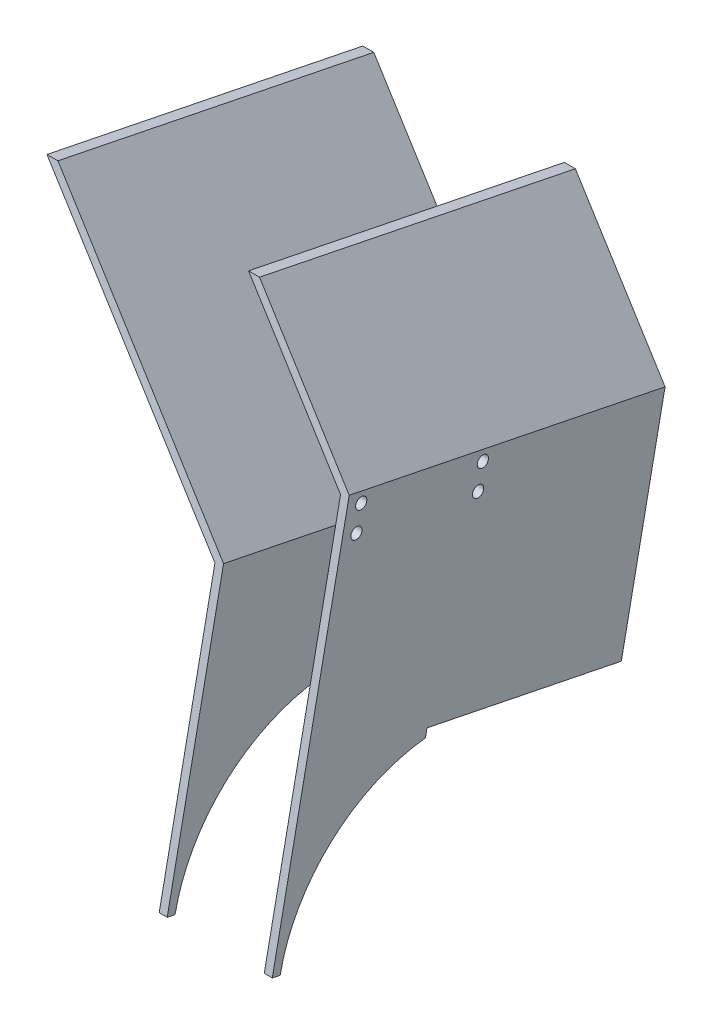
ISO-10303-21;
HEADER;
FILE_DESCRIPTION(('STEP AP214'),'2;1');
FILE_NAME('part.step','',(''),(''),'','','');
FILE_SCHEMA(('AUTOMOTIVE_DESIGN { 1 0 10303 214 1 1 1 1 }'));
ENDSEC;
DATA;
#1=APPLICATION_CONTEXT('core data for automotive mechanical design processes');
#2=APPLICATION_PROTOCOL_DEFINITION('international standard','automotive_design',2000,#1);
#3=PRODUCT_CONTEXT('',#1,'mechanical');
#4=PRODUCT('Part','Part','',(#3));
#5=PRODUCT_RELATED_PRODUCT_CATEGORY('part','',(#4));
#6=PRODUCT_DEFINITION_FORMATION('','',#4);
#7=PRODUCT_DEFINITION_CONTEXT('part definition',#1,'design');
#8=PRODUCT_DEFINITION('design','',#6,#7);
#9=PRODUCT_DEFINITION_SHAPE('','',#8);
#10=(LENGTH_UNIT() NAMED_UNIT(*) SI_UNIT(.MILLI.,.METRE.));
#11=(NAMED_UNIT(*) PLANE_ANGLE_UNIT() SI_UNIT($,.RADIAN.));
#12=(NAMED_UNIT(*) SI_UNIT($,.STERADIAN.) SOLID_ANGLE_UNIT());
#13=UNCERTAINTY_MEASURE_WITH_UNIT(LENGTH_MEASURE(1.E-05),#10,'distance_accuracy_value','');
#14=(GEOMETRIC_REPRESENTATION_CONTEXT(3) GLOBAL_UNCERTAINTY_ASSIGNED_CONTEXT((#13)) GLOBAL_UNIT_ASSIGNED_CONTEXT((#10,
#11,#12)) REPRESENTATION_CONTEXT('',''));
#15=CARTESIAN_POINT('',(0.,0.,0.));
#16=DIRECTION('',(0.,0.,1.));
#17=DIRECTION('',(1.,0.,0.));
#18=AXIS2_PLACEMENT_3D('',#15,#16,#17);
#19=CARTESIAN_POINT('',(159.080275109057,1919.97424519418,76.7488064249174));
#20=DIRECTION('',(1.,0.,0.));
#21=DIRECTION('',(0.,1.,0.));
#22=AXIS2_PLACEMENT_3D('',#19,#20,#21);
#23=PLANE('',#22);
#24=CARTESIAN_POINT('',(159.080275109057,1897.13965743949,28.5631304945984));
#25=DIRECTION('',(1.,0.,0.));
#26=DIRECTION('',(0.,1.,0.));
#27=AXIS2_PLACEMENT_3D('',#24,#25,#26);
#28=CIRCLE('',#27,2.09999999999996);
#29=CARTESIAN_POINT('',(159.080275109057,1899.23965743949,28.5631304945984));
#30=VERTEX_POINT('',#29);
#31=EDGE_CURVE('E227',#30,#30,#28,.T.);
#32=ORIENTED_EDGE('',*,*,#31,.F.);
#33=EDGE_LOOP('',(#32));
#34=FACE_BOUND('',#33,.T.);
#35=CARTESIAN_POINT('',(159.080275109057,1906.35374225666,74.0376639702781));
#36=DIRECTION('',(1.,0.,0.));
#37=DIRECTION('',(0.,1.,0.));
#38=AXIS2_PLACEMENT_3D('',#35,#36,#37);
#39=CIRCLE('',#38,2.09999999999997);
#40=CARTESIAN_POINT('',(159.080275109057,1908.45374225666,74.0376639702781));
#41=VERTEX_POINT('',#40);
#42=EDGE_CURVE('E231',#41,#41,#39,.T.);
#43=ORIENTED_EDGE('',*,*,#42,.F.);
#44=EDGE_LOOP('',(#43));
#45=FACE_BOUND('',#44,.T.);
#46=CARTESIAN_POINT('',(159.080275109057,1915.17449474312,72.2503963426735));
#47=DIRECTION('',(1.,0.,0.));
#48=DIRECTION('',(0.,1.,0.));
#49=AXIS2_PLACEMENT_3D('',#46,#47,#48);
#50=CIRCLE('',#49,2.09999999999997);
#51=CARTESIAN_POINT('',(159.080275109057,1917.27449474312,72.2503963426735));
#52=VERTEX_POINT('',#51);
#53=EDGE_CURVE('E147',#52,#52,#50,.T.);
#54=ORIENTED_EDGE('',*,*,#53,.F.);
#55=EDGE_LOOP('',(#54));
#56=FACE_BOUND('',#55,.T.);
#57=CARTESIAN_POINT('',(159.080275109057,1905.96040992594,26.7758628669938));
#58=DIRECTION('',(1.,0.,0.));
#59=DIRECTION('',(0.,1.,0.));
#60=AXIS2_PLACEMENT_3D('',#57,#58,#59);
#61=CIRCLE('',#60,2.09999999999996);
#62=CARTESIAN_POINT('',(159.080275109057,1908.06040992594,26.7758628669938));
#63=VERTEX_POINT('',#62);
#64=EDGE_CURVE('E237',#63,#63,#61,.T.);
#65=ORIENTED_EDGE('',*,*,#64,.F.);
#66=EDGE_LOOP('',(#65));
#67=FACE_BOUND('',#66,.T.);
#68=DIRECTION('',(0.,-0.980083609606203,0.198585291956063));
#69=VECTOR('',#68,1.);
#70=CARTESIAN_POINT('',(159.080275109057,1919.97424519418,76.7488064249174));
#71=LINE('',#70,#69);
#72=CARTESIAN_POINT('',(159.080275109057,1919.97424519418,76.7488064249174));
#73=VERTEX_POINT('',#72);
#74=CARTESIAN_POINT('',(159.080275109057,1778.04751572434,105.506109099799));
#75=VERTEX_POINT('',#74);
#76=EDGE_CURVE('E124',#73,#75,#71,.T.);
#77=ORIENTED_EDGE('',*,*,#76,.T.);
#78=DIRECTION('',(0.,-0.198585291956079,-0.9800836096062));
#79=VECTOR('',#78,1.);
#80=CARTESIAN_POINT('',(159.080275109057,1778.04751572434,105.506109099799));
#81=LINE('',#80,#79);
#82=CARTESIAN_POINT('',(159.080275109057,1777.45175984848,102.56585827098));
#83=VERTEX_POINT('',#82);
#84=EDGE_CURVE('E131',#75,#83,#81,.T.);
#85=ORIENTED_EDGE('',*,*,#84,.T.);
#86=CARTESIAN_POINT('',(159.080275109057,1765.04017910122,41.3106326705928));
#87=DIRECTION('',(-1.,0.,0.));
#88=DIRECTION('',(0.,1.,0.));
#89=AXIS2_PLACEMENT_3D('',#86,#87,#88);
#90=CIRCLE('',#89,62.4999999999993);
#91=CARTESIAN_POINT('',(159.080275109057,1827.15431420823,48.2449112854723));
#92=VERTEX_POINT('',#91);
#93=EDGE_CURVE('E144',#83,#92,#90,.T.);
#94=ORIENTED_EDGE('',*,*,#93,.T.);
#95=DIRECTION('',(0.,0.980083609606205,-0.198585291956053));
#96=VECTOR('',#95,1.);
#97=CARTESIAN_POINT('',(159.080275109057,1830.09456503705,47.6491554096041));
#98=LINE('',#97,#96);
#99=CARTESIAN_POINT('',(159.080275109057,1830.09456503705,47.6491554096041));
#100=VERTEX_POINT('',#99);
#101=EDGE_CURVE('E140',#92,#100,#98,.T.);
#102=ORIENTED_EDGE('',*,*,#101,.T.);
#103=DIRECTION('',(0.,-0.198585291956063,-0.980083609606204));
#104=VECTOR('',#103,1.);
#105=CARTESIAN_POINT('',(159.080275109057,1839.30274132473,93.0945283525446));
#106=LINE('',#105,#104);
#107=CARTESIAN_POINT('',(159.080275109057,1815.37321364403,-25.0055466050029));
#108=VERTEX_POINT('',#107);
#109=EDGE_CURVE('E46',#100,#108,#106,.T.);
#110=ORIENTED_EDGE('',*,*,#109,.T.);
#111=DIRECTION('',(0.,-0.980083609606203,0.198585291956063));
#112=VECTOR('',#111,1.);
#113=CARTESIAN_POINT('',(159.080275109057,1896.04471751347,-41.3512685326301));
#114=LINE('',#113,#112);
#115=CARTESIAN_POINT('',(159.080275109057,1896.04471751347,-41.3512685326301));
#116=VERTEX_POINT('',#115);
#117=EDGE_CURVE('E157',#116,#108,#114,.T.);
#118=ORIENTED_EDGE('',*,*,#117,.F.);
#119=DIRECTION('',(0.,-0.198585291956063,-0.980083609606204));
#120=VECTOR('',#119,1.);
#121=CARTESIAN_POINT('',(159.080275109057,1919.97424519418,76.7488064249174));
#122=LINE('',#121,#120);
#123=EDGE_CURVE('E12',#73,#116,#122,.T.);
#124=ORIENTED_EDGE('',*,*,#123,.F.);
#125=EDGE_LOOP('',(#77,#85,#94,#102,#110,#118,#124));
#126=FACE_BOUND('',#125,.T.);
#127=ADVANCED_FACE('F43',(#34,#45,#56,#67,#126),#23,.T.);
#128=CARTESIAN_POINT('',(159.080275109057,1919.97424519418,76.7488064249174));
#129=DIRECTION('',(0.731353701619166,0.668415414475569,-0.135434843446568));
#130=DIRECTION('',(-0.674631295169795,0.738154872352358,0.));
#131=AXIS2_PLACEMENT_3D('',#128,#129,#130);
#132=PLANE('',#131);
#133=ORIENTED_EDGE('',*,*,#123,.T.);
#134=DIRECTION('',(0.681998360062503,-0.716787775781771,0.145236088359189));
#135=VECTOR('',#134,1.);
#136=CARTESIAN_POINT('',(159.080275109057,1896.04471751347,-41.3512685326301));
#137=LINE('',#136,#135);
#138=CARTESIAN_POINT('',(116.474442893766,1940.82391567185,-50.4244639750205));
#139=VERTEX_POINT('',#138);
#140=EDGE_CURVE('E175',#139,#116,#137,.T.);
#141=ORIENTED_EDGE('',*,*,#140,.F.);
#142=DIRECTION('',(0.,-0.198585291956063,-0.980083609606204));
#143=VECTOR('',#142,1.);
#144=CARTESIAN_POINT('',(116.474442893766,1964.75344335256,67.6756109825271));
#145=LINE('',#144,#143);
#146=CARTESIAN_POINT('',(116.474442893766,1964.75344335256,67.6756109825271));
#147=VERTEX_POINT('',#146);
#148=EDGE_CURVE('E51',#147,#139,#145,.T.);
#149=ORIENTED_EDGE('',*,*,#148,.F.);
#150=DIRECTION('',(0.681998360062503,-0.716787775781771,0.145236088359189));
#151=VECTOR('',#150,1.);
#152=CARTESIAN_POINT('',(159.080275109057,1919.97424519418,76.7488064249174));
#153=LINE('',#152,#151);
#154=EDGE_CURVE('E183',#147,#73,#153,.T.);
#155=ORIENTED_EDGE('',*,*,#154,.T.);
#156=EDGE_LOOP('',(#133,#141,#149,#155));
#157=FACE_BOUND('',#156,.T.);
#158=ADVANCED_FACE('F200',(#157),#132,.T.);
#159=CARTESIAN_POINT('',(116.474442893766,1964.75344335256,67.6756109825271));
#160=DIRECTION('',(0.,0.980083609606204,-0.198585291956063));
#161=DIRECTION('',(0.,0.198585291956063,0.980083609606204));
#162=AXIS2_PLACEMENT_3D('',#159,#160,#161);
#163=PLANE('',#162);
#164=ORIENTED_EDGE('',*,*,#148,.T.);
#165=DIRECTION('',(1.,0.,0.));
#166=VECTOR('',#165,1.);
#167=CARTESIAN_POINT('',(116.474442893766,1940.82391567185,-50.4244639750205));
#168=LINE('',#167,#166);
#169=CARTESIAN_POINT('',(112.37246051047,1940.82391567185,-50.4244639750205));
#170=VERTEX_POINT('',#169);
#171=EDGE_CURVE('E172',#170,#139,#168,.T.);
#172=ORIENTED_EDGE('',*,*,#171,.F.);
#173=DIRECTION('',(0.,-0.198585291956063,-0.980083609606204));
#174=VECTOR('',#173,1.);
#175=CARTESIAN_POINT('',(112.37246051047,1964.75344335256,67.6756109825271));
#176=LINE('',#175,#174);
#177=CARTESIAN_POINT('',(112.37246051047,1964.75344335256,67.6756109825271));
#178=VERTEX_POINT('',#177);
#179=EDGE_CURVE('E187',#178,#170,#176,.T.);
#180=ORIENTED_EDGE('',*,*,#179,.F.);
#181=DIRECTION('',(1.,0.,0.));
#182=VECTOR('',#181,1.);
#183=CARTESIAN_POINT('',(116.474442893766,1964.75344335256,67.6756109825271));
#184=LINE('',#183,#182);
#185=EDGE_CURVE('E180',#178,#147,#184,.T.);
#186=ORIENTED_EDGE('',*,*,#185,.T.);
#187=EDGE_LOOP('',(#164,#172,#180,#186));
#188=FACE_BOUND('',#187,.T.);
#189=ADVANCED_FACE('F211',(#188),#163,.T.);
#190=CARTESIAN_POINT('',(156.080275109057,1918.81604959177,76.9834809053312));
#191=DIRECTION('',(-0.731353701619167,-0.668415414475569,0.135434843446568));
#192=DIRECTION('',(0.674631295169794,-0.738154872352358,0.));
#193=AXIS2_PLACEMENT_3D('',#190,#191,#192);
#194=PLANE('',#193);
#195=ORIENTED_EDGE('',*,*,#179,.T.);
#196=DIRECTION('',(-0.681998360062502,0.716787775781771,-0.145236088359189));
#197=VECTOR('',#196,1.);
#198=CARTESIAN_POINT('',(156.080275109057,1894.88652191106,-41.1165940522164));
#199=LINE('',#198,#197);
#200=CARTESIAN_POINT('',(156.080275109057,1894.88652191106,-41.1165940522164));
#201=VERTEX_POINT('',#200);
#202=EDGE_CURVE('E169',#201,#170,#199,.T.);
#203=ORIENTED_EDGE('',*,*,#202,.F.);
#204=DIRECTION('',(0.,-0.198585291956063,-0.980083609606204));
#205=VECTOR('',#204,1.);
#206=CARTESIAN_POINT('',(156.080275109057,1918.81604959177,76.9834809053312));
#207=LINE('',#206,#205);
#208=CARTESIAN_POINT('',(156.080275109057,1918.81604959177,76.9834809053312));
#209=VERTEX_POINT('',#208);
#210=EDGE_CURVE('E189',#209,#201,#207,.T.);
#211=ORIENTED_EDGE('',*,*,#210,.F.);
#212=DIRECTION('',(-0.681998360062502,0.716787775781771,-0.145236088359189));
#213=VECTOR('',#212,1.);
#214=CARTESIAN_POINT('',(156.080275109057,1918.81604959177,76.9834809053312));
#215=LINE('',#214,#213);
#216=EDGE_CURVE('E121',#209,#178,#215,.T.);
#217=ORIENTED_EDGE('',*,*,#216,.T.);
#218=EDGE_LOOP('',(#195,#203,#211,#217));
#219=FACE_BOUND('',#218,.T.);
#220=ADVANCED_FACE('F209',(#219),#194,.T.);
#221=CARTESIAN_POINT('',(156.080275109057,1839.30274132473,93.0945283525446));
#222=DIRECTION('',(-1.,0.,0.));
#223=DIRECTION('',(0.,-1.,0.));
#224=AXIS2_PLACEMENT_3D('',#221,#222,#223);
#225=PLANE('',#224);
#226=CARTESIAN_POINT('',(156.080275109057,1897.13965743949,28.5631304945984));
#227=DIRECTION('',(1.,0.,0.));
#228=DIRECTION('',(0.,1.,0.));
#229=AXIS2_PLACEMENT_3D('',#226,#227,#228);
#230=CIRCLE('',#229,2.09999999999996);
#231=CARTESIAN_POINT('',(156.080275109057,1899.23965743949,28.5631304945984));
#232=VERTEX_POINT('',#231);
#233=EDGE_CURVE('E153',#232,#232,#230,.T.);
#234=ORIENTED_EDGE('',*,*,#233,.T.);
#235=EDGE_LOOP('',(#234));
#236=FACE_BOUND('',#235,.T.);
#237=CARTESIAN_POINT('',(156.080275109057,1906.35374225666,74.0376639702781));
#238=DIRECTION('',(1.,0.,0.));
#239=DIRECTION('',(0.,1.,0.));
#240=AXIS2_PLACEMENT_3D('',#237,#238,#239);
#241=CIRCLE('',#240,2.09999999999997);
#242=CARTESIAN_POINT('',(156.080275109057,1908.45374225666,74.0376639702781));
#243=VERTEX_POINT('',#242);
#244=EDGE_CURVE('E247',#243,#243,#241,.T.);
#245=ORIENTED_EDGE('',*,*,#244,.T.);
#246=EDGE_LOOP('',(#245));
#247=FACE_BOUND('',#246,.T.);
#248=CARTESIAN_POINT('',(156.080275109057,1915.17449474312,72.2503963426735));
#249=DIRECTION('',(1.,0.,0.));
#250=DIRECTION('',(0.,1.,0.));
#251=AXIS2_PLACEMENT_3D('',#248,#249,#250);
#252=CIRCLE('',#251,2.09999999999997);
#253=CARTESIAN_POINT('',(156.080275109057,1917.27449474312,72.2503963426735));
#254=VERTEX_POINT('',#253);
#255=EDGE_CURVE('E240',#254,#254,#252,.T.);
#256=ORIENTED_EDGE('',*,*,#255,.T.);
#257=EDGE_LOOP('',(#256));
#258=FACE_BOUND('',#257,.T.);
#259=CARTESIAN_POINT('',(156.080275109057,1905.96040992594,26.7758628669938));
#260=DIRECTION('',(1.,0.,0.));
#261=DIRECTION('',(0.,1.,0.));
#262=AXIS2_PLACEMENT_3D('',#259,#260,#261);
#263=CIRCLE('',#262,2.09999999999996);
#264=CARTESIAN_POINT('',(156.080275109057,1908.06040992594,26.7758628669938));
#265=VERTEX_POINT('',#264);
#266=EDGE_CURVE('E239',#265,#265,#263,.T.);
#267=ORIENTED_EDGE('',*,*,#266,.T.);
#268=EDGE_LOOP('',(#267));
#269=FACE_BOUND('',#268,.T.);
#270=ORIENTED_EDGE('',*,*,#210,.T.);
#271=DIRECTION('',(0.,0.980083609606203,-0.198585291956063));
#272=VECTOR('',#271,1.);
#273=CARTESIAN_POINT('',(156.080275109057,1815.37321364403,-25.0055466050029));
#274=LINE('',#273,#272);
#275=CARTESIAN_POINT('',(156.080275109057,1815.37321364403,-25.0055466050029));
#276=VERTEX_POINT('',#275);
#277=EDGE_CURVE('E166',#276,#201,#274,.T.);
#278=ORIENTED_EDGE('',*,*,#277,.F.);
#279=DIRECTION('',(0.,-0.198585291956063,-0.980083609606204));
#280=VECTOR('',#279,1.);
#281=CARTESIAN_POINT('',(156.080275109057,1839.30274132473,93.0945283525446));
#282=LINE('',#281,#280);
#283=CARTESIAN_POINT('',(156.080275109057,1830.09456503705,47.6491554096041));
#284=VERTEX_POINT('',#283);
#285=EDGE_CURVE('E190',#284,#276,#282,.T.);
#286=ORIENTED_EDGE('',*,*,#285,.F.);
#287=DIRECTION('',(0.,0.980083609606205,-0.198585291956053));
#288=VECTOR('',#287,1.);
#289=CARTESIAN_POINT('',(156.080275109057,1830.09456503705,47.6491554096041));
#290=LINE('',#289,#288);
#291=CARTESIAN_POINT('',(156.080275109057,1827.15431420823,48.2449112854723));
#292=VERTEX_POINT('',#291);
#293=EDGE_CURVE('E133',#292,#284,#290,.T.);
#294=ORIENTED_EDGE('',*,*,#293,.F.);
#295=CARTESIAN_POINT('',(156.080275109057,1765.04017910122,41.3106326705928));
#296=DIRECTION('',(-1.,0.,0.));
#297=DIRECTION('',(0.,1.,0.));
#298=AXIS2_PLACEMENT_3D('',#295,#296,#297);
#299=CIRCLE('',#298,62.4999999999993);
#300=CARTESIAN_POINT('',(156.080275109057,1777.45175984848,102.56585827098));
#301=VERTEX_POINT('',#300);
#302=EDGE_CURVE('E139',#301,#292,#299,.T.);
#303=ORIENTED_EDGE('',*,*,#302,.F.);
#304=DIRECTION('',(0.,-0.198585291956079,-0.9800836096062));
#305=VECTOR('',#304,1.);
#306=CARTESIAN_POINT('',(156.080275109057,1778.04751572434,105.506109099799));
#307=LINE('',#306,#305);
#308=CARTESIAN_POINT('',(156.080275109057,1778.04751572434,105.506109099799));
#309=VERTEX_POINT('',#308);
#310=EDGE_CURVE('E129',#309,#301,#307,.T.);
#311=ORIENTED_EDGE('',*,*,#310,.F.);
#312=DIRECTION('',(0.,0.980083609606203,-0.198585291956063));
#313=VECTOR('',#312,1.);
#314=CARTESIAN_POINT('',(156.080275109057,1839.30274132473,93.0945283525446));
#315=LINE('',#314,#313);
#316=EDGE_CURVE('E114',#309,#209,#315,.T.);
#317=ORIENTED_EDGE('',*,*,#316,.T.);
#318=EDGE_LOOP('',(#270,#278,#286,#294,#303,#311,#317));
#319=FACE_BOUND('',#318,.T.);
#320=ADVANCED_FACE('F136',(#236,#247,#258,#269,#319),#225,.T.);
#321=CARTESIAN_POINT('',(159.080275109057,1839.30274132473,93.0945283525446));
#322=DIRECTION('',(0.,-0.980083609606204,0.198585291956063));
#323=DIRECTION('',(0.,-0.198585291956063,-0.980083609606204));
#324=AXIS2_PLACEMENT_3D('',#321,#322,#323);
#325=PLANE('',#324);
#326=DIRECTION('',(1.,0.,0.));
#327=VECTOR('',#326,1.);
#328=CARTESIAN_POINT('',(156.080275109057,1830.09456503705,47.6491554096041));
#329=LINE('',#328,#327);
#330=EDGE_CURVE('E59',#284,#100,#329,.T.);
#331=ORIENTED_EDGE('',*,*,#330,.F.);
#332=ORIENTED_EDGE('',*,*,#285,.T.);
#333=DIRECTION('',(-1.,0.,0.));
#334=VECTOR('',#333,1.);
#335=CARTESIAN_POINT('',(159.080275109057,1815.37321364403,-25.0055466050029));
#336=LINE('',#335,#334);
#337=EDGE_CURVE('E163',#108,#276,#336,.T.);
#338=ORIENTED_EDGE('',*,*,#337,.F.);
#339=ORIENTED_EDGE('',*,*,#109,.F.);
#340=EDGE_LOOP('',(#331,#332,#338,#339));
#341=FACE_BOUND('',#340,.T.);
#342=ADVANCED_FACE('F193',(#341),#325,.T.);
#343=CARTESIAN_POINT('',(0.,90.6539659964331,447.407083091329));
#344=DIRECTION('',(0.,-0.198585291956063,-0.980083609606204));
#345=DIRECTION('',(0.,0.980083609606203,-0.198585291956063));
#346=AXIS2_PLACEMENT_3D('',#343,#344,#345);
#347=PLANE('',#346);
#348=ORIENTED_EDGE('',*,*,#76,.F.);
#349=ORIENTED_EDGE('',*,*,#154,.F.);
#350=ORIENTED_EDGE('',*,*,#185,.F.);
#351=ORIENTED_EDGE('',*,*,#216,.F.);
#352=ORIENTED_EDGE('',*,*,#316,.F.);
#353=DIRECTION('',(1.,0.,0.));
#354=VECTOR('',#353,1.);
#355=CARTESIAN_POINT('',(156.080275109057,1778.04751572434,105.506109099799));
#356=LINE('',#355,#354);
#357=EDGE_CURVE('E117',#309,#75,#356,.T.);
#358=ORIENTED_EDGE('',*,*,#357,.T.);
#359=EDGE_LOOP('',(#348,#349,#350,#351,#352,#358));
#360=FACE_BOUND('',#359,.T.);
#361=ADVANCED_FACE('F116',(#360),#347,.F.);
#362=CARTESIAN_POINT('',(0.,66.7244383157275,329.307008133781));
#363=DIRECTION('',(0.,-0.198585291956063,-0.980083609606204));
#364=DIRECTION('',(0.,0.980083609606203,-0.198585291956063));
#365=AXIS2_PLACEMENT_3D('',#362,#363,#364);
#366=PLANE('',#365);
#367=ORIENTED_EDGE('',*,*,#117,.T.);
#368=ORIENTED_EDGE('',*,*,#337,.T.);
#369=ORIENTED_EDGE('',*,*,#277,.T.);
#370=ORIENTED_EDGE('',*,*,#202,.T.);
#371=ORIENTED_EDGE('',*,*,#171,.T.);
#372=ORIENTED_EDGE('',*,*,#140,.T.);
#373=EDGE_LOOP('',(#367,#368,#369,#370,#371,#372));
#374=FACE_BOUND('',#373,.T.);
#375=ADVANCED_FACE('F196',(#374),#366,.T.);
#376=CARTESIAN_POINT('',(156.080275109057,1830.09456503705,47.6491554096041));
#377=DIRECTION('',(0.,-0.198585291956053,-0.980083609606206));
#378=DIRECTION('',(0.,0.980083609606206,-0.198585291956053));
#379=AXIS2_PLACEMENT_3D('',#376,#377,#378);
#380=PLANE('',#379);
#381=ORIENTED_EDGE('',*,*,#101,.F.);
#382=DIRECTION('',(1.,0.,0.));
#383=VECTOR('',#382,1.);
#384=CARTESIAN_POINT('',(156.080275109057,1827.15431420823,48.2449112854723));
#385=LINE('',#384,#383);
#386=EDGE_CURVE('E158',#292,#92,#385,.T.);
#387=ORIENTED_EDGE('',*,*,#386,.F.);
#388=ORIENTED_EDGE('',*,*,#293,.T.);
#389=ORIENTED_EDGE('',*,*,#330,.T.);
#390=EDGE_LOOP('',(#381,#387,#388,#389));
#391=FACE_BOUND('',#390,.T.);
#392=ADVANCED_FACE('F206',(#391),#380,.T.);
#393=CARTESIAN_POINT('',(156.080275109057,1765.04017910122,41.3106326705928));
#394=DIRECTION('',(1.,0.,0.));
#395=DIRECTION('',(0.,1.,0.));
#396=AXIS2_PLACEMENT_3D('',#393,#394,#395);
#397=CYLINDRICAL_SURFACE('',#396,62.4999999999993);
#398=ORIENTED_EDGE('',*,*,#93,.F.);
#399=DIRECTION('',(1.,0.,0.));
#400=VECTOR('',#399,1.);
#401=CARTESIAN_POINT('',(156.080275109057,1777.45175984848,102.56585827098));
#402=LINE('',#401,#400);
#403=EDGE_CURVE('E132',#301,#83,#402,.T.);
#404=ORIENTED_EDGE('',*,*,#403,.F.);
#405=ORIENTED_EDGE('',*,*,#302,.T.);
#406=ORIENTED_EDGE('',*,*,#386,.T.);
#407=EDGE_LOOP('',(#398,#404,#405,#406));
#408=FACE_BOUND('',#407,.T.);
#409=ADVANCED_FACE('F204',(#408),#397,.F.);
#410=CARTESIAN_POINT('',(156.080275109057,1778.04751572434,105.506109099799));
#411=DIRECTION('',(0.,-0.9800836096062,0.198585291956079));
#412=DIRECTION('',(0.,-0.198585291956079,-0.980083609606201));
#413=AXIS2_PLACEMENT_3D('',#410,#411,#412);
#414=PLANE('',#413);
#415=ORIENTED_EDGE('',*,*,#84,.F.);
#416=ORIENTED_EDGE('',*,*,#357,.F.);
#417=ORIENTED_EDGE('',*,*,#310,.T.);
#418=ORIENTED_EDGE('',*,*,#403,.T.);
#419=EDGE_LOOP('',(#415,#416,#417,#418));
#420=FACE_BOUND('',#419,.T.);
#421=ADVANCED_FACE('F128',(#420),#414,.T.);
#422=CARTESIAN_POINT('',(156.080275109057,1905.96040992594,26.7758628669938));
#423=DIRECTION('',(1.,0.,0.));
#424=DIRECTION('',(0.,1.,0.));
#425=AXIS2_PLACEMENT_3D('',#422,#423,#424);
#426=CYLINDRICAL_SURFACE('',#425,2.09999999999996);
#427=ORIENTED_EDGE('',*,*,#266,.F.);
#428=EDGE_LOOP('',(#427));
#429=FACE_BOUND('',#428,.T.);
#430=ORIENTED_EDGE('',*,*,#64,.T.);
#431=EDGE_LOOP('',(#430));
#432=FACE_BOUND('',#431,.T.);
#433=ADVANCED_FACE('F268',(#429,#432),#426,.F.);
#434=CARTESIAN_POINT('',(156.080275109057,1915.17449474312,72.2503963426735));
#435=DIRECTION('',(1.,0.,0.));
#436=DIRECTION('',(0.,1.,0.));
#437=AXIS2_PLACEMENT_3D('',#434,#435,#436);
#438=CYLINDRICAL_SURFACE('',#437,2.09999999999997);
#439=ORIENTED_EDGE('',*,*,#255,.F.);
#440=EDGE_LOOP('',(#439));
#441=FACE_BOUND('',#440,.T.);
#442=ORIENTED_EDGE('',*,*,#53,.T.);
#443=EDGE_LOOP('',(#442));
#444=FACE_BOUND('',#443,.T.);
#445=ADVANCED_FACE('F264',(#441,#444),#438,.F.);
#446=CARTESIAN_POINT('',(156.080275109057,1906.35374225666,74.0376639702781));
#447=DIRECTION('',(1.,0.,0.));
#448=DIRECTION('',(0.,1.,0.));
#449=AXIS2_PLACEMENT_3D('',#446,#447,#448);
#450=CYLINDRICAL_SURFACE('',#449,2.09999999999997);
#451=ORIENTED_EDGE('',*,*,#244,.F.);
#452=EDGE_LOOP('',(#451));
#453=FACE_BOUND('',#452,.T.);
#454=ORIENTED_EDGE('',*,*,#42,.T.);
#455=EDGE_LOOP('',(#454));
#456=FACE_BOUND('',#455,.T.);
#457=ADVANCED_FACE('F259',(#453,#456),#450,.F.);
#458=CARTESIAN_POINT('',(156.080275109057,1897.13965743949,28.5631304945984));
#459=DIRECTION('',(1.,0.,0.));
#460=DIRECTION('',(0.,1.,0.));
#461=AXIS2_PLACEMENT_3D('',#458,#459,#460);
#462=CYLINDRICAL_SURFACE('',#461,2.09999999999996);
#463=ORIENTED_EDGE('',*,*,#233,.F.);
#464=EDGE_LOOP('',(#463));
#465=FACE_BOUND('',#464,.T.);
#466=ORIENTED_EDGE('',*,*,#31,.T.);
#467=EDGE_LOOP('',(#466));
#468=FACE_BOUND('',#467,.T.);
#469=ADVANCED_FACE('F256',(#465,#468),#462,.F.);
#470=CLOSED_SHELL('',(#127,#158,#189,#220,#320,#342,#361,#375,#392,#409,#421,#433,#445,#457,#469));
#471=MANIFOLD_SOLID_BREP('B2',#470);
#472=CARTESIAN_POINT('',(41.0963774211715,1964.75344335256,67.6756109825271));
#473=DIRECTION('',(0.,0.980083609606204,-0.198585291956063));
#474=DIRECTION('',(0.,0.198585291956063,0.980083609606204));
#475=AXIS2_PLACEMENT_3D('',#472,#473,#474);
#476=PLANE('',#475);
#477=DIRECTION('',(0.,-0.198585291956063,-0.980083609606204));
#478=VECTOR('',#477,1.);
#479=CARTESIAN_POINT('',(41.0963774211715,1964.75344335256,67.6756109825271));
#480=LINE('',#479,#478);
#481=CARTESIAN_POINT('',(41.0963774211715,1964.75344335256,67.6756109825271));
#482=VERTEX_POINT('',#481);
#483=CARTESIAN_POINT('',(41.0963774211715,1940.82391567185,-50.4244639750205));
#484=VERTEX_POINT('',#483);
#485=EDGE_CURVE('E393',#482,#484,#480,.T.);
#486=ORIENTED_EDGE('',*,*,#485,.T.);
#487=DIRECTION('',(1.,0.,0.));
#488=VECTOR('',#487,1.);
#489=CARTESIAN_POINT('',(41.0963774211715,1940.82391567185,-50.4244639750205));
#490=LINE('',#489,#488);
#491=CARTESIAN_POINT('',(36.9943950378757,1940.82391567185,-50.4244639750205));
#492=VERTEX_POINT('',#491);
#493=EDGE_CURVE('E501',#492,#484,#490,.T.);
#494=ORIENTED_EDGE('',*,*,#493,.F.);
#495=DIRECTION('',(0.,-0.198585291956063,-0.980083609606204));
#496=VECTOR('',#495,1.);
#497=CARTESIAN_POINT('',(36.9943950378757,1964.75344335256,67.6756109825271));
#498=LINE('',#497,#496);
#499=CARTESIAN_POINT('',(36.9943950378757,1964.75344335256,67.6756109825271));
#500=VERTEX_POINT('',#499);
#501=EDGE_CURVE('E41',#500,#492,#498,.T.);
#502=ORIENTED_EDGE('',*,*,#501,.F.);
#503=DIRECTION('',(1.,0.,0.));
#504=VECTOR('',#503,1.);
#505=CARTESIAN_POINT('',(41.0963774211715,1964.75344335256,67.6756109825271));
#506=LINE('',#505,#504);
#507=EDGE_CURVE('E522',#500,#482,#506,.T.);
#508=ORIENTED_EDGE('',*,*,#507,.T.);
#509=EDGE_LOOP('',(#486,#494,#502,#508));
#510=FACE_BOUND('',#509,.T.);
#511=ADVANCED_FACE('F390',(#510),#476,.T.);
#512=CARTESIAN_POINT('',(36.9943950378757,1964.75344335256,67.6756109825271));
#513=DIRECTION('',(-0.731353701619166,-0.668415414475569,0.135434843446568));
#514=DIRECTION('',(0.674631295169795,-0.738154872352357,0.));
#515=AXIS2_PLACEMENT_3D('',#512,#513,#514);
#516=PLANE('',#515);
#517=ORIENTED_EDGE('',*,*,#501,.T.);
#518=DIRECTION('',(-0.681998360062503,0.716787775781771,-0.14523608835919));
#519=VECTOR('',#518,1.);
#520=CARTESIAN_POINT('',(36.9943950378757,1940.82391567185,-50.4244639750205));
#521=LINE('',#520,#519);
#522=CARTESIAN_POINT('',(116.791940296289,1856.9558181395,-33.431045790063));
#523=VERTEX_POINT('',#522);
#524=EDGE_CURVE('E519',#523,#492,#521,.T.);
#525=ORIENTED_EDGE('',*,*,#524,.F.);
#526=DIRECTION('',(0.,-0.198585291956063,-0.980083609606204));
#527=VECTOR('',#526,1.);
#528=CARTESIAN_POINT('',(116.791940296289,1880.88534582021,84.6690291674846));
#529=LINE('',#528,#527);
#530=CARTESIAN_POINT('',(116.791940296289,1880.88534582021,84.6690291674846));
#531=VERTEX_POINT('',#530);
#532=EDGE_CURVE('E398',#531,#523,#529,.T.);
#533=ORIENTED_EDGE('',*,*,#532,.F.);
#534=DIRECTION('',(-0.681998360062503,0.716787775781771,-0.14523608835919));
#535=VECTOR('',#534,1.);
#536=CARTESIAN_POINT('',(36.9943950378757,1964.75344335256,67.6756109825271));
#537=LINE('',#536,#535);
#538=EDGE_CURVE('E469',#531,#500,#537,.T.);
#539=ORIENTED_EDGE('',*,*,#538,.T.);
#540=EDGE_LOOP('',(#517,#525,#533,#539));
#541=FACE_BOUND('',#540,.T.);
#542=ADVANCED_FACE('F544',(#541),#516,.T.);
#543=CARTESIAN_POINT('',(116.791940296289,1880.88534582021,84.6690291674846));
#544=DIRECTION('',(-1.,0.,0.));
#545=DIRECTION('',(0.,0.,1.));
#546=AXIS2_PLACEMENT_3D('',#543,#544,#545);
#547=PLANE('',#546);
#548=ORIENTED_EDGE('',*,*,#532,.T.);
#549=DIRECTION('',(0.,0.980083609606204,-0.198585291956063));
#550=VECTOR('',#549,1.);
#551=CARTESIAN_POINT('',(116.791940296289,1856.9558181395,-33.431045790063));
#552=LINE('',#551,#550);
#553=CARTESIAN_POINT('',(116.791940296289,1815.37321364403,-25.0055466050029));
#554=VERTEX_POINT('',#553);
#555=EDGE_CURVE('E516',#554,#523,#552,.T.);
#556=ORIENTED_EDGE('',*,*,#555,.F.);
#557=DIRECTION('',(0.,-0.198585291956063,-0.980083609606204));
#558=VECTOR('',#557,1.);
#559=CARTESIAN_POINT('',(116.791940296289,1839.30274132473,93.0945283525446));
#560=LINE('',#559,#558);
#561=CARTESIAN_POINT('',(116.791940296289,1830.09456503705,47.6491554096046));
#562=VERTEX_POINT('',#561);
#563=EDGE_CURVE('E530',#562,#554,#560,.T.);
#564=ORIENTED_EDGE('',*,*,#563,.F.);
#565=DIRECTION('',(0.,0.980083609606204,-0.198585291956062));
#566=VECTOR('',#565,1.);
#567=CARTESIAN_POINT('',(116.791940296289,1830.09456503705,47.6491554096046));
#568=LINE('',#567,#566);
#569=CARTESIAN_POINT('',(116.791940296289,1827.15431420823,48.2449112854728));
#570=VERTEX_POINT('',#569);
#571=EDGE_CURVE('E481',#570,#562,#568,.T.);
#572=ORIENTED_EDGE('',*,*,#571,.F.);
#573=CARTESIAN_POINT('',(116.791940296289,1765.04017910122,41.3106326705928));
#574=DIRECTION('',(-1.,0.,0.));
#575=DIRECTION('',(0.,1.,0.));
#576=AXIS2_PLACEMENT_3D('',#573,#574,#575);
#577=CIRCLE('',#576,62.4999999999994);
#578=CARTESIAN_POINT('',(116.791940296289,1777.45175984848,102.56585827098));
#579=VERTEX_POINT('',#578);
#580=EDGE_CURVE('E487',#579,#570,#577,.T.);
#581=ORIENTED_EDGE('',*,*,#580,.F.);
#582=DIRECTION('',(0.,-0.198585291956153,-0.980083609606185));
#583=VECTOR('',#582,1.);
#584=CARTESIAN_POINT('',(116.791940296289,1778.04751572434,105.506109099799));
#585=LINE('',#584,#583);
#586=CARTESIAN_POINT('',(116.791940296289,1778.04751572434,105.506109099799));
#587=VERTEX_POINT('',#586);
#588=EDGE_CURVE('E477',#587,#579,#585,.T.);
#589=ORIENTED_EDGE('',*,*,#588,.F.);
#590=DIRECTION('',(0.,0.980083609606204,-0.198585291956063));
#591=VECTOR('',#590,1.);
#592=CARTESIAN_POINT('',(116.791940296289,1880.88534582021,84.6690291674846));
#593=LINE('',#592,#591);
#594=EDGE_CURVE('E462',#587,#531,#593,.T.);
#595=ORIENTED_EDGE('',*,*,#594,.T.);
#596=EDGE_LOOP('',(#548,#556,#564,#572,#581,#589,#595));
#597=FACE_BOUND('',#596,.T.);
#598=ADVANCED_FACE('F484',(#597),#547,.T.);
#599=CARTESIAN_POINT('',(116.791940296289,1839.30274132473,93.0945283525446));
#600=DIRECTION('',(0.,-0.980083609606204,0.198585291956063));
#601=DIRECTION('',(0.,-0.198585291956063,-0.980083609606204));
#602=AXIS2_PLACEMENT_3D('',#599,#600,#601);
#603=PLANE('',#602);
#604=DIRECTION('',(1.,0.,0.));
#605=VECTOR('',#604,1.);
#606=CARTESIAN_POINT('',(116.791940296289,1830.09456503705,47.6491554096046));
#607=LINE('',#606,#605);
#608=CARTESIAN_POINT('',(119.791940296289,1830.09456503705,47.6491554096046));
#609=VERTEX_POINT('',#608);
#610=EDGE_CURVE('E406',#562,#609,#607,.T.);
#611=ORIENTED_EDGE('',*,*,#610,.F.);
#612=ORIENTED_EDGE('',*,*,#563,.T.);
#613=DIRECTION('',(-1.,0.,0.));
#614=VECTOR('',#613,1.);
#615=CARTESIAN_POINT('',(116.791940296289,1815.37321364403,-25.0055466050029));
#616=LINE('',#615,#614);
#617=CARTESIAN_POINT('',(119.791940296289,1815.37321364403,-25.0055466050029));
#618=VERTEX_POINT('',#617);
#619=EDGE_CURVE('E513',#618,#554,#616,.T.);
#620=ORIENTED_EDGE('',*,*,#619,.F.);
#621=DIRECTION('',(0.,-0.198585291956063,-0.980083609606204));
#622=VECTOR('',#621,1.);
#623=CARTESIAN_POINT('',(119.791940296289,1839.30274132473,93.0945283525446));
#624=LINE('',#623,#622);
#625=EDGE_CURVE('E532',#609,#618,#624,.T.);
#626=ORIENTED_EDGE('',*,*,#625,.F.);
#627=EDGE_LOOP('',(#611,#612,#620,#626));
#628=FACE_BOUND('',#627,.T.);
#629=ADVANCED_FACE('F554',(#628),#603,.T.);
#630=CARTESIAN_POINT('',(119.791940296289,1839.30274132473,93.0945283525446));
#631=DIRECTION('',(1.,0.,0.));
#632=DIRECTION('',(0.,0.,-1.));
#633=AXIS2_PLACEMENT_3D('',#630,#631,#632);
#634=PLANE('',#633);
#635=DIRECTION('',(0.,-0.980083609606203,0.198585291956063));
#636=VECTOR('',#635,1.);
#637=CARTESIAN_POINT('',(119.791940296289,1839.30274132473,93.0945283525446));
#638=LINE('',#637,#636);
#639=CARTESIAN_POINT('',(119.791940296289,1882.04354142262,84.434354687071));
#640=VERTEX_POINT('',#639);
#641=CARTESIAN_POINT('',(119.791940296289,1778.04751572434,105.506109099799));
#642=VERTEX_POINT('',#641);
#643=EDGE_CURVE('E472',#640,#642,#638,.T.);
#644=ORIENTED_EDGE('',*,*,#643,.T.);
#645=DIRECTION('',(0.,-0.198585291956153,-0.980083609606185));
#646=VECTOR('',#645,1.);
#647=CARTESIAN_POINT('',(119.791940296289,1778.04751572434,105.506109099799));
#648=LINE('',#647,#646);
#649=CARTESIAN_POINT('',(119.791940296289,1777.45175984848,102.56585827098));
#650=VERTEX_POINT('',#649);
#651=EDGE_CURVE('E479',#642,#650,#648,.T.);
#652=ORIENTED_EDGE('',*,*,#651,.T.);
#653=CARTESIAN_POINT('',(119.791940296289,1765.04017910122,41.3106326705928));
#654=DIRECTION('',(-1.,0.,0.));
#655=DIRECTION('',(0.,1.,0.));
#656=AXIS2_PLACEMENT_3D('',#653,#654,#655);
#657=CIRCLE('',#656,62.4999999999994);
#658=CARTESIAN_POINT('',(119.791940296289,1827.15431420823,48.2449112854728));
#659=VERTEX_POINT('',#658);
#660=EDGE_CURVE('E492',#650,#659,#657,.T.);
#661=ORIENTED_EDGE('',*,*,#660,.T.);
#662=DIRECTION('',(0.,0.980083609606204,-0.198585291956062));
#663=VECTOR('',#662,1.);
#664=CARTESIAN_POINT('',(119.791940296289,1830.09456503705,47.6491554096046));
#665=LINE('',#664,#663);
#666=EDGE_CURVE('E488',#659,#609,#665,.T.);
#667=ORIENTED_EDGE('',*,*,#666,.T.);
#668=ORIENTED_EDGE('',*,*,#625,.T.);
#669=DIRECTION('',(0.,-0.980083609606203,0.198585291956063));
#670=VECTOR('',#669,1.);
#671=CARTESIAN_POINT('',(119.791940296289,1815.37321364403,-25.0055466050029));
#672=LINE('',#671,#670);
#673=CARTESIAN_POINT('',(119.791940296289,1858.11401374191,-33.6657202704766));
#674=VERTEX_POINT('',#673);
#675=EDGE_CURVE('E510',#674,#618,#672,.T.);
#676=ORIENTED_EDGE('',*,*,#675,.F.);
#677=DIRECTION('',(0.,-0.198585291956063,-0.980083609606204));
#678=VECTOR('',#677,1.);
#679=CARTESIAN_POINT('',(119.791940296289,1882.04354142262,84.434354687071));
#680=LINE('',#679,#678);
#681=EDGE_CURVE('E533',#640,#674,#680,.T.);
#682=ORIENTED_EDGE('',*,*,#681,.F.);
#683=EDGE_LOOP('',(#644,#652,#661,#667,#668,#676,#682));
#684=FACE_BOUND('',#683,.T.);
#685=ADVANCED_FACE('F553',(#684),#634,.T.);
#686=CARTESIAN_POINT('',(119.791940296289,1882.04354142262,84.434354687071));
#687=DIRECTION('',(0.731353701619167,0.668415414475569,-0.135434843446568));
#688=DIRECTION('',(-0.674631295169794,0.738154872352358,0.));
#689=AXIS2_PLACEMENT_3D('',#686,#687,#688);
#690=PLANE('',#689);
#691=ORIENTED_EDGE('',*,*,#681,.T.);
#692=DIRECTION('',(0.681998360062502,-0.716787775781771,0.14523608835919));
#693=VECTOR('',#692,1.);
#694=CARTESIAN_POINT('',(119.791940296289,1858.11401374191,-33.6657202704766));
#695=LINE('',#694,#693);
#696=EDGE_CURVE('E507',#484,#674,#695,.T.);
#697=ORIENTED_EDGE('',*,*,#696,.F.);
#698=ORIENTED_EDGE('',*,*,#485,.F.);
#699=DIRECTION('',(0.681998360062502,-0.716787775781771,0.14523608835919));
#700=VECTOR('',#699,1.);
#701=CARTESIAN_POINT('',(119.791940296289,1882.04354142262,84.434354687071));
#702=LINE('',#701,#700);
#703=EDGE_CURVE('E524',#482,#640,#702,.T.);
#704=ORIENTED_EDGE('',*,*,#703,.T.);
#705=EDGE_LOOP('',(#691,#697,#698,#704));
#706=FACE_BOUND('',#705,.T.);
#707=ADVANCED_FACE('F537',(#706),#690,.T.);
#708=CARTESIAN_POINT('',(0.,90.6539659964328,447.407083091328));
#709=DIRECTION('',(0.,0.198585291956063,0.980083609606204));
#710=DIRECTION('',(0.,-0.980083609606204,0.198585291956063));
#711=AXIS2_PLACEMENT_3D('',#708,#709,#710);
#712=PLANE('',#711);
#713=ORIENTED_EDGE('',*,*,#507,.F.);
#714=ORIENTED_EDGE('',*,*,#538,.F.);
#715=ORIENTED_EDGE('',*,*,#594,.F.);
#716=DIRECTION('',(1.,0.,0.));
#717=VECTOR('',#716,1.);
#718=CARTESIAN_POINT('',(116.791940296289,1778.04751572434,105.506109099799));
#719=LINE('',#718,#717);
#720=EDGE_CURVE('E466',#587,#642,#719,.T.);
#721=ORIENTED_EDGE('',*,*,#720,.T.);
#722=ORIENTED_EDGE('',*,*,#643,.F.);
#723=ORIENTED_EDGE('',*,*,#703,.F.);
#724=EDGE_LOOP('',(#713,#714,#715,#721,#722,#723));
#725=FACE_BOUND('',#724,.T.);
#726=ADVANCED_FACE('F464',(#725),#712,.T.);
#727=CARTESIAN_POINT('',(0.,66.7244383157272,329.30700813378));
#728=DIRECTION('',(0.,0.198585291956063,0.980083609606204));
#729=DIRECTION('',(0.,-0.980083609606204,0.198585291956063));
#730=AXIS2_PLACEMENT_3D('',#727,#728,#729);
#731=PLANE('',#730);
#732=ORIENTED_EDGE('',*,*,#493,.T.);
#733=ORIENTED_EDGE('',*,*,#696,.T.);
#734=ORIENTED_EDGE('',*,*,#675,.T.);
#735=ORIENTED_EDGE('',*,*,#619,.T.);
#736=ORIENTED_EDGE('',*,*,#555,.T.);
#737=ORIENTED_EDGE('',*,*,#524,.T.);
#738=EDGE_LOOP('',(#732,#733,#734,#735,#736,#737));
#739=FACE_BOUND('',#738,.T.);
#740=ADVANCED_FACE('F540',(#739),#731,.F.);
#741=CARTESIAN_POINT('',(116.791940296289,1830.09456503705,47.6491554096046));
#742=DIRECTION('',(0.,-0.198585291956062,-0.980083609606204));
#743=DIRECTION('',(0.,0.980083609606204,-0.198585291956062));
#744=AXIS2_PLACEMENT_3D('',#741,#742,#743);
#745=PLANE('',#744);
#746=ORIENTED_EDGE('',*,*,#666,.F.);
#747=DIRECTION('',(1.,0.,0.));
#748=VECTOR('',#747,1.);
#749=CARTESIAN_POINT('',(116.791940296289,1827.15431420823,48.2449112854728));
#750=LINE('',#749,#748);
#751=EDGE_CURVE('E502',#570,#659,#750,.T.);
#752=ORIENTED_EDGE('',*,*,#751,.F.);
#753=ORIENTED_EDGE('',*,*,#571,.T.);
#754=ORIENTED_EDGE('',*,*,#610,.T.);
#755=EDGE_LOOP('',(#746,#752,#753,#754));
#756=FACE_BOUND('',#755,.T.);
#757=ADVANCED_FACE('F548',(#756),#745,.T.);
#758=CARTESIAN_POINT('',(116.791940296289,1765.04017910122,41.3106326705928));
#759=DIRECTION('',(1.,0.,0.));
#760=DIRECTION('',(0.,1.,0.));
#761=AXIS2_PLACEMENT_3D('',#758,#759,#760);
#762=CYLINDRICAL_SURFACE('',#761,62.4999999999994);
#763=ORIENTED_EDGE('',*,*,#660,.F.);
#764=DIRECTION('',(1.,0.,0.));
#765=VECTOR('',#764,1.);
#766=CARTESIAN_POINT('',(116.791940296289,1777.45175984848,102.56585827098));
#767=LINE('',#766,#765);
#768=EDGE_CURVE('E480',#579,#650,#767,.T.);
#769=ORIENTED_EDGE('',*,*,#768,.F.);
#770=ORIENTED_EDGE('',*,*,#580,.T.);
#771=ORIENTED_EDGE('',*,*,#751,.T.);
#772=EDGE_LOOP('',(#763,#769,#770,#771));
#773=FACE_BOUND('',#772,.T.);
#774=ADVANCED_FACE('F551',(#773),#762,.F.);
#775=CARTESIAN_POINT('',(116.791940296289,1778.04751572434,105.506109099799));
#776=DIRECTION('',(0.,-0.980083609606185,0.198585291956153));
#777=DIRECTION('',(0.,-0.198585291956153,-0.980083609606185));
#778=AXIS2_PLACEMENT_3D('',#775,#776,#777);
#779=PLANE('',#778);
#780=ORIENTED_EDGE('',*,*,#651,.F.);
#781=ORIENTED_EDGE('',*,*,#720,.F.);
#782=ORIENTED_EDGE('',*,*,#588,.T.);
#783=ORIENTED_EDGE('',*,*,#768,.T.);
#784=EDGE_LOOP('',(#780,#781,#782,#783));
#785=FACE_BOUND('',#784,.T.);
#786=ADVANCED_FACE('F476',(#785),#779,.T.);
#787=CLOSED_SHELL('',(#511,#542,#598,#629,#685,#707,#726,#740,#757,#774,#786));
#788=MANIFOLD_SOLID_BREP('B6',#787);
#789=ADVANCED_BREP_SHAPE_REPRESENTATION('',(#18,#471,#788),#14);
#790=SHAPE_DEFINITION_REPRESENTATION(#9,#789);
ENDSEC;
END-ISO-10303-21;
